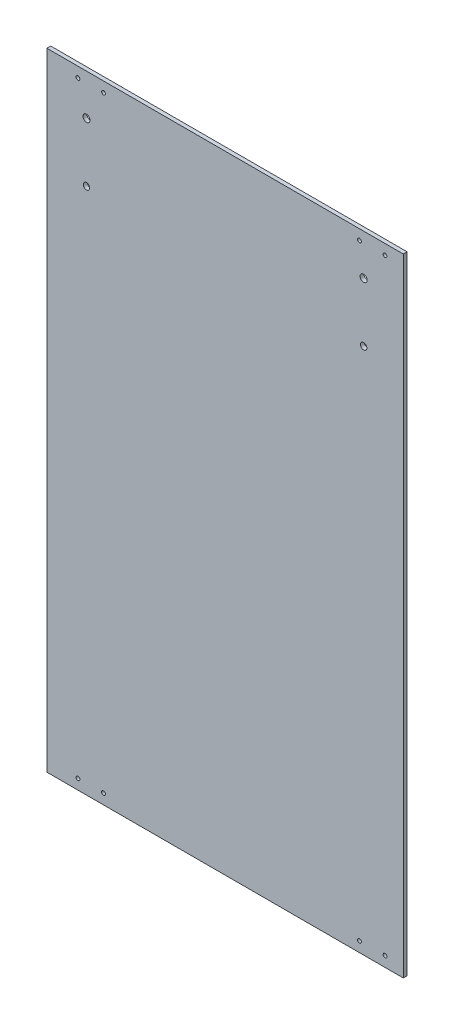
ISO-10303-21;
HEADER;
FILE_DESCRIPTION(('STEP AP214'),'2;1');
FILE_NAME('part.step','',(''),(''),'','','');
FILE_SCHEMA(('AUTOMOTIVE_DESIGN { 1 0 10303 214 1 1 1 1 }'));
ENDSEC;
DATA;
#1=APPLICATION_CONTEXT('core data for automotive mechanical design processes');
#2=APPLICATION_PROTOCOL_DEFINITION('international standard','automotive_design',2000,#1);
#3=PRODUCT_CONTEXT('',#1,'mechanical');
#4=PRODUCT('Part','Part','',(#3));
#5=PRODUCT_RELATED_PRODUCT_CATEGORY('part','',(#4));
#6=PRODUCT_DEFINITION_FORMATION('','',#4);
#7=PRODUCT_DEFINITION_CONTEXT('part definition',#1,'design');
#8=PRODUCT_DEFINITION('design','',#6,#7);
#9=PRODUCT_DEFINITION_SHAPE('','',#8);
#10=(LENGTH_UNIT() NAMED_UNIT(*) SI_UNIT(.MILLI.,.METRE.));
#11=(NAMED_UNIT(*) PLANE_ANGLE_UNIT() SI_UNIT($,.RADIAN.));
#12=(NAMED_UNIT(*) SI_UNIT($,.STERADIAN.) SOLID_ANGLE_UNIT());
#13=UNCERTAINTY_MEASURE_WITH_UNIT(LENGTH_MEASURE(1.E-05),#10,'distance_accuracy_value','');
#14=(GEOMETRIC_REPRESENTATION_CONTEXT(3) GLOBAL_UNCERTAINTY_ASSIGNED_CONTEXT((#13)) GLOBAL_UNIT_ASSIGNED_CONTEXT((#10,
#11,#12)) REPRESENTATION_CONTEXT('',''));
#15=CARTESIAN_POINT('',(0.,0.,0.));
#16=DIRECTION('',(0.,0.,1.));
#17=DIRECTION('',(1.,0.,0.));
#18=AXIS2_PLACEMENT_3D('',#15,#16,#17);
#19=CARTESIAN_POINT('',(0.,0.,3.));
#20=DIRECTION('',(0.,0.,1.));
#21=DIRECTION('',(1.,0.,0.));
#22=AXIS2_PLACEMENT_3D('',#19,#20,#21);
#23=PLANE('',#22);
#24=CARTESIAN_POINT('',(-108.284794003432,213.088125341744,3.));
#25=DIRECTION('',(0.,0.,-1.));
#26=DIRECTION('',(-1.,0.,0.));
#27=AXIS2_PLACEMENT_3D('',#24,#25,#26);
#28=CIRCLE('',#27,2.75);
#29=CARTESIAN_POINT('',(-111.034794003432,213.088125341744,3.));
#30=VERTEX_POINT('',#29);
#31=EDGE_CURVE('E116',#30,#30,#28,.T.);
#32=ORIENTED_EDGE('',*,*,#31,.T.);
#33=EDGE_LOOP('',(#32));
#34=FACE_BOUND('',#33,.T.);
#35=CARTESIAN_POINT('',(108.275205996571,213.088125341673,3.));
#36=DIRECTION('',(0.,0.,-1.));
#37=DIRECTION('',(-1.,0.,0.));
#38=AXIS2_PLACEMENT_3D('',#35,#36,#37);
#39=CIRCLE('',#38,2.75000000000001);
#40=CARTESIAN_POINT('',(105.525205996571,213.088125341673,3.));
#41=VERTEX_POINT('',#40);
#42=EDGE_CURVE('E122',#41,#41,#39,.T.);
#43=ORIENTED_EDGE('',*,*,#42,.T.);
#44=EDGE_LOOP('',(#43));
#45=FACE_BOUND('',#44,.T.);
#46=CARTESIAN_POINT('',(108.275205996571,167.088125341673,3.));
#47=DIRECTION('',(0.,0.,1.));
#48=DIRECTION('',(1.,0.,0.));
#49=AXIS2_PLACEMENT_3D('',#46,#47,#48);
#50=CIRCLE('',#49,2.5);
#51=CARTESIAN_POINT('',(110.775205996571,167.088125341673,3.));
#52=VERTEX_POINT('',#51);
#53=EDGE_CURVE('E137',#52,#52,#50,.T.);
#54=ORIENTED_EDGE('',*,*,#53,.F.);
#55=EDGE_LOOP('',(#54));
#56=FACE_BOUND('',#55,.T.);
#57=CARTESIAN_POINT('',(-108.284794003432,167.088125341744,3.));
#58=DIRECTION('',(0.,0.,1.));
#59=DIRECTION('',(1.,0.,0.));
#60=AXIS2_PLACEMENT_3D('',#57,#58,#59);
#61=CIRCLE('',#60,2.5);
#62=CARTESIAN_POINT('',(-105.784794003432,167.088125341744,3.));
#63=VERTEX_POINT('',#62);
#64=EDGE_CURVE('E132',#63,#63,#61,.T.);
#65=ORIENTED_EDGE('',*,*,#64,.F.);
#66=EDGE_LOOP('',(#65));
#67=FACE_BOUND('',#66,.T.);
#68=CARTESIAN_POINT('',(-95.000929926417,-237.,3.));
#69=DIRECTION('',(0.,0.,1.));
#70=DIRECTION('',(1.,0.,0.));
#71=AXIS2_PLACEMENT_3D('',#68,#69,#70);
#72=CIRCLE('',#71,1.5);
#73=CARTESIAN_POINT('',(-93.500929926417,-237.,3.));
#74=VERTEX_POINT('',#73);
#75=EDGE_CURVE('E147',#74,#74,#72,.T.);
#76=ORIENTED_EDGE('',*,*,#75,.F.);
#77=EDGE_LOOP('',(#76));
#78=FACE_BOUND('',#77,.T.);
#79=CARTESIAN_POINT('',(124.999070073583,-237.,3.));
#80=DIRECTION('',(0.,0.,1.));
#81=DIRECTION('',(1.,0.,0.));
#82=AXIS2_PLACEMENT_3D('',#79,#80,#81);
#83=CIRCLE('',#82,1.5);
#84=CARTESIAN_POINT('',(126.499070073583,-237.,3.));
#85=VERTEX_POINT('',#84);
#86=EDGE_CURVE('E159',#85,#85,#83,.T.);
#87=ORIENTED_EDGE('',*,*,#86,.F.);
#88=EDGE_LOOP('',(#87));
#89=FACE_BOUND('',#88,.T.);
#90=CARTESIAN_POINT('',(-95.0009299264166,237.,3.));
#91=DIRECTION('',(0.,0.,1.));
#92=DIRECTION('',(1.,0.,0.));
#93=AXIS2_PLACEMENT_3D('',#90,#91,#92);
#94=CIRCLE('',#93,1.5);
#95=CARTESIAN_POINT('',(-93.5009299264166,237.,3.));
#96=VERTEX_POINT('',#95);
#97=EDGE_CURVE('E171',#96,#96,#94,.T.);
#98=ORIENTED_EDGE('',*,*,#97,.F.);
#99=EDGE_LOOP('',(#98));
#100=FACE_BOUND('',#99,.T.);
#101=CARTESIAN_POINT('',(104.999070073583,237.,3.));
#102=DIRECTION('',(0.,0.,1.));
#103=DIRECTION('',(1.,0.,0.));
#104=AXIS2_PLACEMENT_3D('',#101,#102,#103);
#105=CIRCLE('',#104,1.5);
#106=CARTESIAN_POINT('',(106.499070073583,237.,3.));
#107=VERTEX_POINT('',#106);
#108=EDGE_CURVE('E109',#107,#107,#105,.T.);
#109=ORIENTED_EDGE('',*,*,#108,.F.);
#110=EDGE_LOOP('',(#109));
#111=FACE_BOUND('',#110,.T.);
#112=DIRECTION('',(0.,1.,0.));
#113=VECTOR('',#112,1.);
#114=CARTESIAN_POINT('',(139.28,245.,3.));
#115=LINE('',#114,#113);
#116=CARTESIAN_POINT('',(139.28,-245.,3.));
#117=VERTEX_POINT('',#116);
#118=CARTESIAN_POINT('',(139.28,245.,3.));
#119=VERTEX_POINT('',#118);
#120=EDGE_CURVE('E93',#117,#119,#115,.T.);
#121=ORIENTED_EDGE('',*,*,#120,.T.);
#122=DIRECTION('',(-1.,0.,0.));
#123=VECTOR('',#122,1.);
#124=CARTESIAN_POINT('',(-139.28,245.,3.));
#125=LINE('',#124,#123);
#126=CARTESIAN_POINT('',(-139.28,245.,3.));
#127=VERTEX_POINT('',#126);
#128=EDGE_CURVE('E88',#119,#127,#125,.T.);
#129=ORIENTED_EDGE('',*,*,#128,.T.);
#130=DIRECTION('',(0.,-1.,0.));
#131=VECTOR('',#130,1.);
#132=CARTESIAN_POINT('',(-139.28,245.,3.));
#133=LINE('',#132,#131);
#134=CARTESIAN_POINT('',(-139.28,-245.,3.));
#135=VERTEX_POINT('',#134);
#136=EDGE_CURVE('E91',#127,#135,#133,.T.);
#137=ORIENTED_EDGE('',*,*,#136,.T.);
#138=DIRECTION('',(1.,0.,0.));
#139=VECTOR('',#138,1.);
#140=CARTESIAN_POINT('',(-139.28,-245.,3.));
#141=LINE('',#140,#139);
#142=EDGE_CURVE('E58',#135,#117,#141,.T.);
#143=ORIENTED_EDGE('',*,*,#142,.T.);
#144=EDGE_LOOP('',(#121,#129,#137,#143));
#145=FACE_BOUND('',#144,.T.);
#146=CARTESIAN_POINT('',(124.999070073583,237.,3.));
#147=DIRECTION('',(0.,0.,1.));
#148=DIRECTION('',(1.,0.,0.));
#149=AXIS2_PLACEMENT_3D('',#146,#147,#148);
#150=CIRCLE('',#149,1.5);
#151=CARTESIAN_POINT('',(126.499070073583,237.,3.));
#152=VERTEX_POINT('',#151);
#153=EDGE_CURVE('E177',#152,#152,#150,.T.);
#154=ORIENTED_EDGE('',*,*,#153,.F.);
#155=EDGE_LOOP('',(#154));
#156=FACE_BOUND('',#155,.T.);
#157=CARTESIAN_POINT('',(-115.000929926417,237.,3.));
#158=DIRECTION('',(0.,0.,1.));
#159=DIRECTION('',(1.,0.,0.));
#160=AXIS2_PLACEMENT_3D('',#157,#158,#159);
#161=CIRCLE('',#160,1.5);
#162=CARTESIAN_POINT('',(-113.500929926417,237.,3.));
#163=VERTEX_POINT('',#162);
#164=EDGE_CURVE('E165',#163,#163,#161,.T.);
#165=ORIENTED_EDGE('',*,*,#164,.F.);
#166=EDGE_LOOP('',(#165));
#167=FACE_BOUND('',#166,.T.);
#168=CARTESIAN_POINT('',(104.999070073583,-237.,3.));
#169=DIRECTION('',(0.,0.,1.));
#170=DIRECTION('',(1.,0.,0.));
#171=AXIS2_PLACEMENT_3D('',#168,#169,#170);
#172=CIRCLE('',#171,1.5);
#173=CARTESIAN_POINT('',(106.499070073583,-237.,3.));
#174=VERTEX_POINT('',#173);
#175=EDGE_CURVE('E153',#174,#174,#172,.T.);
#176=ORIENTED_EDGE('',*,*,#175,.F.);
#177=EDGE_LOOP('',(#176));
#178=FACE_BOUND('',#177,.T.);
#179=CARTESIAN_POINT('',(-115.000929926417,-237.,3.));
#180=DIRECTION('',(0.,0.,1.));
#181=DIRECTION('',(1.,0.,0.));
#182=AXIS2_PLACEMENT_3D('',#179,#180,#181);
#183=CIRCLE('',#182,1.5);
#184=CARTESIAN_POINT('',(-113.500929926417,-237.,3.));
#185=VERTEX_POINT('',#184);
#186=EDGE_CURVE('E141',#185,#185,#183,.T.);
#187=ORIENTED_EDGE('',*,*,#186,.F.);
#188=EDGE_LOOP('',(#187));
#189=FACE_BOUND('',#188,.T.);
#190=ADVANCED_FACE('F39',(#34,#45,#56,#67,#78,#89,#100,#111,#145,#156,#167,#178,#189),#23,.T.);
#191=CARTESIAN_POINT('',(0.,0.,0.));
#192=DIRECTION('',(0.,0.,1.));
#193=DIRECTION('',(1.,0.,0.));
#194=AXIS2_PLACEMENT_3D('',#191,#192,#193);
#195=PLANE('',#194);
#196=CARTESIAN_POINT('',(-108.284794003432,213.088125341744,0.));
#197=DIRECTION('',(0.,0.,1.));
#198=DIRECTION('',(1.,0.,0.));
#199=AXIS2_PLACEMENT_3D('',#196,#197,#198);
#200=CIRCLE('',#199,2.75);
#201=CARTESIAN_POINT('',(-105.534794003432,213.088125341744,0.));
#202=VERTEX_POINT('',#201);
#203=EDGE_CURVE('E43',#202,#202,#200,.T.);
#204=ORIENTED_EDGE('',*,*,#203,.T.);
#205=EDGE_LOOP('',(#204));
#206=FACE_BOUND('',#205,.T.);
#207=CARTESIAN_POINT('',(108.275205996571,213.088125341673,0.));
#208=DIRECTION('',(0.,0.,1.));
#209=DIRECTION('',(1.,0.,0.));
#210=AXIS2_PLACEMENT_3D('',#207,#208,#209);
#211=CIRCLE('',#210,2.75000000000001);
#212=CARTESIAN_POINT('',(111.025205996571,213.088125341673,0.));
#213=VERTEX_POINT('',#212);
#214=EDGE_CURVE('E114',#213,#213,#211,.T.);
#215=ORIENTED_EDGE('',*,*,#214,.T.);
#216=EDGE_LOOP('',(#215));
#217=FACE_BOUND('',#216,.T.);
#218=CARTESIAN_POINT('',(108.275205996571,167.088125341673,0.));
#219=DIRECTION('',(0.,0.,-1.));
#220=DIRECTION('',(-1.,0.,0.));
#221=AXIS2_PLACEMENT_3D('',#218,#219,#220);
#222=CIRCLE('',#221,2.5);
#223=CARTESIAN_POINT('',(105.775205996571,167.088125341673,0.));
#224=VERTEX_POINT('',#223);
#225=EDGE_CURVE('E129',#224,#224,#222,.T.);
#226=ORIENTED_EDGE('',*,*,#225,.F.);
#227=EDGE_LOOP('',(#226));
#228=FACE_BOUND('',#227,.T.);
#229=CARTESIAN_POINT('',(-108.284794003432,167.088125341744,0.));
#230=DIRECTION('',(0.,0.,-1.));
#231=DIRECTION('',(-1.,0.,0.));
#232=AXIS2_PLACEMENT_3D('',#229,#230,#231);
#233=CIRCLE('',#232,2.5);
#234=CARTESIAN_POINT('',(-110.784794003432,167.088125341744,0.));
#235=VERTEX_POINT('',#234);
#236=EDGE_CURVE('E120',#235,#235,#233,.T.);
#237=ORIENTED_EDGE('',*,*,#236,.F.);
#238=EDGE_LOOP('',(#237));
#239=FACE_BOUND('',#238,.T.);
#240=DIRECTION('',(0.,1.,0.));
#241=VECTOR('',#240,1.);
#242=CARTESIAN_POINT('',(139.28,245.,0.));
#243=LINE('',#242,#241);
#244=CARTESIAN_POINT('',(139.28,-245.,0.));
#245=VERTEX_POINT('',#244);
#246=CARTESIAN_POINT('',(139.28,245.,0.));
#247=VERTEX_POINT('',#246);
#248=EDGE_CURVE('E106',#245,#247,#243,.T.);
#249=ORIENTED_EDGE('',*,*,#248,.F.);
#250=DIRECTION('',(1.,0.,0.));
#251=VECTOR('',#250,1.);
#252=CARTESIAN_POINT('',(-139.28,-245.,0.));
#253=LINE('',#252,#251);
#254=CARTESIAN_POINT('',(-139.28,-245.,0.));
#255=VERTEX_POINT('',#254);
#256=EDGE_CURVE('E81',#255,#245,#253,.T.);
#257=ORIENTED_EDGE('',*,*,#256,.F.);
#258=DIRECTION('',(0.,-1.,0.));
#259=VECTOR('',#258,1.);
#260=CARTESIAN_POINT('',(-139.28,245.,0.));
#261=LINE('',#260,#259);
#262=CARTESIAN_POINT('',(-139.28,245.,0.));
#263=VERTEX_POINT('',#262);
#264=EDGE_CURVE('E75',#263,#255,#261,.T.);
#265=ORIENTED_EDGE('',*,*,#264,.F.);
#266=DIRECTION('',(-1.,0.,0.));
#267=VECTOR('',#266,1.);
#268=CARTESIAN_POINT('',(-139.28,245.,0.));
#269=LINE('',#268,#267);
#270=EDGE_CURVE('E97',#247,#263,#269,.T.);
#271=ORIENTED_EDGE('',*,*,#270,.F.);
#272=EDGE_LOOP('',(#249,#257,#265,#271));
#273=FACE_BOUND('',#272,.T.);
#274=CARTESIAN_POINT('',(104.999070073583,237.,0.));
#275=DIRECTION('',(0.,0.,1.));
#276=DIRECTION('',(1.,0.,0.));
#277=AXIS2_PLACEMENT_3D('',#274,#275,#276);
#278=CIRCLE('',#277,1.5);
#279=CARTESIAN_POINT('',(106.499070073583,237.,0.));
#280=VERTEX_POINT('',#279);
#281=EDGE_CURVE('E180',#280,#280,#278,.T.);
#282=ORIENTED_EDGE('',*,*,#281,.T.);
#283=EDGE_LOOP('',(#282));
#284=FACE_BOUND('',#283,.T.);
#285=CARTESIAN_POINT('',(124.999070073583,237.,0.));
#286=DIRECTION('',(0.,0.,1.));
#287=DIRECTION('',(1.,0.,0.));
#288=AXIS2_PLACEMENT_3D('',#285,#286,#287);
#289=CIRCLE('',#288,1.5);
#290=CARTESIAN_POINT('',(126.499070073583,237.,0.));
#291=VERTEX_POINT('',#290);
#292=EDGE_CURVE('E174',#291,#291,#289,.T.);
#293=ORIENTED_EDGE('',*,*,#292,.T.);
#294=EDGE_LOOP('',(#293));
#295=FACE_BOUND('',#294,.T.);
#296=CARTESIAN_POINT('',(-95.0009299264166,237.,0.));
#297=DIRECTION('',(0.,0.,1.));
#298=DIRECTION('',(1.,0.,0.));
#299=AXIS2_PLACEMENT_3D('',#296,#297,#298);
#300=CIRCLE('',#299,1.5);
#301=CARTESIAN_POINT('',(-93.5009299264166,237.,0.));
#302=VERTEX_POINT('',#301);
#303=EDGE_CURVE('E168',#302,#302,#300,.T.);
#304=ORIENTED_EDGE('',*,*,#303,.T.);
#305=EDGE_LOOP('',(#304));
#306=FACE_BOUND('',#305,.T.);
#307=CARTESIAN_POINT('',(-115.000929926417,237.,0.));
#308=DIRECTION('',(0.,0.,1.));
#309=DIRECTION('',(1.,0.,0.));
#310=AXIS2_PLACEMENT_3D('',#307,#308,#309);
#311=CIRCLE('',#310,1.5);
#312=CARTESIAN_POINT('',(-113.500929926417,237.,0.));
#313=VERTEX_POINT('',#312);
#314=EDGE_CURVE('E162',#313,#313,#311,.T.);
#315=ORIENTED_EDGE('',*,*,#314,.T.);
#316=EDGE_LOOP('',(#315));
#317=FACE_BOUND('',#316,.T.);
#318=CARTESIAN_POINT('',(124.999070073583,-237.,0.));
#319=DIRECTION('',(0.,0.,1.));
#320=DIRECTION('',(1.,0.,0.));
#321=AXIS2_PLACEMENT_3D('',#318,#319,#320);
#322=CIRCLE('',#321,1.5);
#323=CARTESIAN_POINT('',(126.499070073583,-237.,0.));
#324=VERTEX_POINT('',#323);
#325=EDGE_CURVE('E156',#324,#324,#322,.T.);
#326=ORIENTED_EDGE('',*,*,#325,.T.);
#327=EDGE_LOOP('',(#326));
#328=FACE_BOUND('',#327,.T.);
#329=CARTESIAN_POINT('',(104.999070073583,-237.,0.));
#330=DIRECTION('',(0.,0.,1.));
#331=DIRECTION('',(1.,0.,0.));
#332=AXIS2_PLACEMENT_3D('',#329,#330,#331);
#333=CIRCLE('',#332,1.5);
#334=CARTESIAN_POINT('',(106.499070073583,-237.,0.));
#335=VERTEX_POINT('',#334);
#336=EDGE_CURVE('E150',#335,#335,#333,.T.);
#337=ORIENTED_EDGE('',*,*,#336,.T.);
#338=EDGE_LOOP('',(#337));
#339=FACE_BOUND('',#338,.T.);
#340=CARTESIAN_POINT('',(-95.000929926417,-237.,0.));
#341=DIRECTION('',(0.,0.,1.));
#342=DIRECTION('',(1.,0.,0.));
#343=AXIS2_PLACEMENT_3D('',#340,#341,#342);
#344=CIRCLE('',#343,1.5);
#345=CARTESIAN_POINT('',(-93.500929926417,-237.,0.));
#346=VERTEX_POINT('',#345);
#347=EDGE_CURVE('E144',#346,#346,#344,.T.);
#348=ORIENTED_EDGE('',*,*,#347,.T.);
#349=EDGE_LOOP('',(#348));
#350=FACE_BOUND('',#349,.T.);
#351=CARTESIAN_POINT('',(-115.000929926417,-237.,0.));
#352=DIRECTION('',(0.,0.,1.));
#353=DIRECTION('',(1.,0.,0.));
#354=AXIS2_PLACEMENT_3D('',#351,#352,#353);
#355=CIRCLE('',#354,1.5);
#356=CARTESIAN_POINT('',(-113.500929926417,-237.,0.));
#357=VERTEX_POINT('',#356);
#358=EDGE_CURVE('E140',#357,#357,#355,.T.);
#359=ORIENTED_EDGE('',*,*,#358,.T.);
#360=EDGE_LOOP('',(#359));
#361=FACE_BOUND('',#360,.T.);
#362=ADVANCED_FACE('F188',(#206,#217,#228,#239,#273,#284,#295,#306,#317,#328,#339,#350,#361),
#195,.F.);
#363=CARTESIAN_POINT('',(139.28,245.,3.));
#364=DIRECTION('',(-1.,0.,0.));
#365=DIRECTION('',(0.,-1.,0.));
#366=AXIS2_PLACEMENT_3D('',#363,#364,#365);
#367=PLANE('',#366);
#368=ORIENTED_EDGE('',*,*,#248,.T.);
#369=DIRECTION('',(0.,0.,-1.));
#370=VECTOR('',#369,1.);
#371=CARTESIAN_POINT('',(139.28,245.,3.));
#372=LINE('',#371,#370);
#373=EDGE_CURVE('E11',#119,#247,#372,.T.);
#374=ORIENTED_EDGE('',*,*,#373,.F.);
#375=ORIENTED_EDGE('',*,*,#120,.F.);
#376=DIRECTION('',(0.,0.,-1.));
#377=VECTOR('',#376,1.);
#378=CARTESIAN_POINT('',(139.28,-245.,3.));
#379=LINE('',#378,#377);
#380=EDGE_CURVE('E102',#117,#245,#379,.T.);
#381=ORIENTED_EDGE('',*,*,#380,.T.);
#382=EDGE_LOOP('',(#368,#374,#375,#381));
#383=FACE_BOUND('',#382,.T.);
#384=ADVANCED_FACE('F41',(#383),#367,.F.);
#385=CARTESIAN_POINT('',(-139.28,245.,3.));
#386=DIRECTION('',(0.,-1.,0.));
#387=DIRECTION('',(0.,0.,-1.));
#388=AXIS2_PLACEMENT_3D('',#385,#386,#387);
#389=PLANE('',#388);
#390=ORIENTED_EDGE('',*,*,#270,.T.);
#391=DIRECTION('',(0.,0.,-1.));
#392=VECTOR('',#391,1.);
#393=CARTESIAN_POINT('',(-139.28,245.,3.));
#394=LINE('',#393,#392);
#395=EDGE_CURVE('E49',#127,#263,#394,.T.);
#396=ORIENTED_EDGE('',*,*,#395,.F.);
#397=ORIENTED_EDGE('',*,*,#128,.F.);
#398=ORIENTED_EDGE('',*,*,#373,.T.);
#399=EDGE_LOOP('',(#390,#396,#397,#398));
#400=FACE_BOUND('',#399,.T.);
#401=ADVANCED_FACE('F96',(#400),#389,.F.);
#402=CARTESIAN_POINT('',(-139.28,245.,3.));
#403=DIRECTION('',(1.,0.,0.));
#404=DIRECTION('',(0.,1.,0.));
#405=AXIS2_PLACEMENT_3D('',#402,#403,#404);
#406=PLANE('',#405);
#407=ORIENTED_EDGE('',*,*,#264,.T.);
#408=DIRECTION('',(0.,0.,-1.));
#409=VECTOR('',#408,1.);
#410=CARTESIAN_POINT('',(-139.28,-245.,3.));
#411=LINE('',#410,#409);
#412=EDGE_CURVE('E98',#135,#255,#411,.T.);
#413=ORIENTED_EDGE('',*,*,#412,.F.);
#414=ORIENTED_EDGE('',*,*,#136,.F.);
#415=ORIENTED_EDGE('',*,*,#395,.T.);
#416=EDGE_LOOP('',(#407,#413,#414,#415));
#417=FACE_BOUND('',#416,.T.);
#418=ADVANCED_FACE('F100',(#417),#406,.F.);
#419=CARTESIAN_POINT('',(-139.28,-245.,3.));
#420=DIRECTION('',(0.,1.,0.));
#421=DIRECTION('',(0.,0.,1.));
#422=AXIS2_PLACEMENT_3D('',#419,#420,#421);
#423=PLANE('',#422);
#424=ORIENTED_EDGE('',*,*,#256,.T.);
#425=ORIENTED_EDGE('',*,*,#380,.F.);
#426=ORIENTED_EDGE('',*,*,#142,.F.);
#427=ORIENTED_EDGE('',*,*,#412,.T.);
#428=EDGE_LOOP('',(#424,#425,#426,#427));
#429=FACE_BOUND('',#428,.T.);
#430=ADVANCED_FACE('F194',(#429),#423,.F.);
#431=CARTESIAN_POINT('',(104.999070073583,237.,3.));
#432=DIRECTION('',(0.,0.,-1.));
#433=DIRECTION('',(-1.,0.,0.));
#434=AXIS2_PLACEMENT_3D('',#431,#432,#433);
#435=CYLINDRICAL_SURFACE('',#434,1.5);
#436=ORIENTED_EDGE('',*,*,#108,.T.);
#437=EDGE_LOOP('',(#436));
#438=FACE_BOUND('',#437,.T.);
#439=ORIENTED_EDGE('',*,*,#281,.F.);
#440=EDGE_LOOP('',(#439));
#441=FACE_BOUND('',#440,.T.);
#442=ADVANCED_FACE('F191',(#438,#441),#435,.F.);
#443=CARTESIAN_POINT('',(124.999070073583,237.,3.));
#444=DIRECTION('',(0.,0.,-1.));
#445=DIRECTION('',(-1.,0.,0.));
#446=AXIS2_PLACEMENT_3D('',#443,#444,#445);
#447=CYLINDRICAL_SURFACE('',#446,1.5);
#448=ORIENTED_EDGE('',*,*,#153,.T.);
#449=EDGE_LOOP('',(#448));
#450=FACE_BOUND('',#449,.T.);
#451=ORIENTED_EDGE('',*,*,#292,.F.);
#452=EDGE_LOOP('',(#451));
#453=FACE_BOUND('',#452,.T.);
#454=ADVANCED_FACE('F193',(#450,#453),#447,.F.);
#455=CARTESIAN_POINT('',(-95.0009299264166,237.,3.));
#456=DIRECTION('',(0.,0.,-1.));
#457=DIRECTION('',(-1.,0.,0.));
#458=AXIS2_PLACEMENT_3D('',#455,#456,#457);
#459=CYLINDRICAL_SURFACE('',#458,1.5);
#460=ORIENTED_EDGE('',*,*,#97,.T.);
#461=EDGE_LOOP('',(#460));
#462=FACE_BOUND('',#461,.T.);
#463=ORIENTED_EDGE('',*,*,#303,.F.);
#464=EDGE_LOOP('',(#463));
#465=FACE_BOUND('',#464,.T.);
#466=ADVANCED_FACE('F201',(#462,#465),#459,.F.);
#467=CARTESIAN_POINT('',(-115.000929926417,237.,3.));
#468=DIRECTION('',(0.,0.,-1.));
#469=DIRECTION('',(-1.,0.,0.));
#470=AXIS2_PLACEMENT_3D('',#467,#468,#469);
#471=CYLINDRICAL_SURFACE('',#470,1.5);
#472=ORIENTED_EDGE('',*,*,#164,.T.);
#473=EDGE_LOOP('',(#472));
#474=FACE_BOUND('',#473,.T.);
#475=ORIENTED_EDGE('',*,*,#314,.F.);
#476=EDGE_LOOP('',(#475));
#477=FACE_BOUND('',#476,.T.);
#478=ADVANCED_FACE('F315',(#474,#477),#471,.F.);
#479=CARTESIAN_POINT('',(124.999070073583,-237.,3.));
#480=DIRECTION('',(0.,0.,-1.));
#481=DIRECTION('',(-1.,0.,0.));
#482=AXIS2_PLACEMENT_3D('',#479,#480,#481);
#483=CYLINDRICAL_SURFACE('',#482,1.5);
#484=ORIENTED_EDGE('',*,*,#86,.T.);
#485=EDGE_LOOP('',(#484));
#486=FACE_BOUND('',#485,.T.);
#487=ORIENTED_EDGE('',*,*,#325,.F.);
#488=EDGE_LOOP('',(#487));
#489=FACE_BOUND('',#488,.T.);
#490=ADVANCED_FACE('F305',(#486,#489),#483,.F.);
#491=CARTESIAN_POINT('',(104.999070073583,-237.,3.));
#492=DIRECTION('',(0.,0.,-1.));
#493=DIRECTION('',(-1.,0.,0.));
#494=AXIS2_PLACEMENT_3D('',#491,#492,#493);
#495=CYLINDRICAL_SURFACE('',#494,1.5);
#496=ORIENTED_EDGE('',*,*,#175,.T.);
#497=EDGE_LOOP('',(#496));
#498=FACE_BOUND('',#497,.T.);
#499=ORIENTED_EDGE('',*,*,#336,.F.);
#500=EDGE_LOOP('',(#499));
#501=FACE_BOUND('',#500,.T.);
#502=ADVANCED_FACE('F295',(#498,#501),#495,.F.);
#503=CARTESIAN_POINT('',(-95.000929926417,-237.,3.));
#504=DIRECTION('',(0.,0.,-1.));
#505=DIRECTION('',(-1.,0.,0.));
#506=AXIS2_PLACEMENT_3D('',#503,#504,#505);
#507=CYLINDRICAL_SURFACE('',#506,1.5);
#508=ORIENTED_EDGE('',*,*,#75,.T.);
#509=EDGE_LOOP('',(#508));
#510=FACE_BOUND('',#509,.T.);
#511=ORIENTED_EDGE('',*,*,#347,.F.);
#512=EDGE_LOOP('',(#511));
#513=FACE_BOUND('',#512,.T.);
#514=ADVANCED_FACE('F285',(#510,#513),#507,.F.);
#515=CARTESIAN_POINT('',(-115.000929926417,-237.,3.));
#516=DIRECTION('',(0.,0.,-1.));
#517=DIRECTION('',(-1.,0.,0.));
#518=AXIS2_PLACEMENT_3D('',#515,#516,#517);
#519=CYLINDRICAL_SURFACE('',#518,1.5);
#520=ORIENTED_EDGE('',*,*,#186,.T.);
#521=EDGE_LOOP('',(#520));
#522=FACE_BOUND('',#521,.T.);
#523=ORIENTED_EDGE('',*,*,#358,.F.);
#524=EDGE_LOOP('',(#523));
#525=FACE_BOUND('',#524,.T.);
#526=ADVANCED_FACE('F275',(#522,#525),#519,.F.);
#527=CARTESIAN_POINT('',(-108.284794003432,167.088125341744,10.));
#528=DIRECTION('',(0.,0.,-1.));
#529=DIRECTION('',(-1.,0.,0.));
#530=AXIS2_PLACEMENT_3D('',#527,#528,#529);
#531=CYLINDRICAL_SURFACE('',#530,2.5);
#532=ORIENTED_EDGE('',*,*,#64,.T.);
#533=EDGE_LOOP('',(#532));
#534=FACE_BOUND('',#533,.T.);
#535=ORIENTED_EDGE('',*,*,#236,.T.);
#536=EDGE_LOOP('',(#535));
#537=FACE_BOUND('',#536,.T.);
#538=ADVANCED_FACE('F266',(#534,#537),#531,.F.);
#539=CARTESIAN_POINT('',(108.275205996571,167.088125341673,10.));
#540=DIRECTION('',(0.,0.,-1.));
#541=DIRECTION('',(-1.,0.,0.));
#542=AXIS2_PLACEMENT_3D('',#539,#540,#541);
#543=CYLINDRICAL_SURFACE('',#542,2.5);
#544=ORIENTED_EDGE('',*,*,#53,.T.);
#545=EDGE_LOOP('',(#544));
#546=FACE_BOUND('',#545,.T.);
#547=ORIENTED_EDGE('',*,*,#225,.T.);
#548=EDGE_LOOP('',(#547));
#549=FACE_BOUND('',#548,.T.);
#550=ADVANCED_FACE('F243',(#546,#549),#543,.F.);
#551=CARTESIAN_POINT('',(108.275205996571,213.088125341673,3.));
#552=DIRECTION('',(0.,0.,-1.));
#553=DIRECTION('',(-1.,0.,0.));
#554=AXIS2_PLACEMENT_3D('',#551,#552,#553);
#555=CYLINDRICAL_SURFACE('',#554,2.75000000000001);
#556=ORIENTED_EDGE('',*,*,#42,.F.);
#557=EDGE_LOOP('',(#556));
#558=FACE_BOUND('',#557,.T.);
#559=ORIENTED_EDGE('',*,*,#214,.F.);
#560=EDGE_LOOP('',(#559));
#561=FACE_BOUND('',#560,.T.);
#562=ADVANCED_FACE('F237',(#558,#561),#555,.F.);
#563=CARTESIAN_POINT('',(-108.284794003432,213.088125341744,3.));
#564=DIRECTION('',(0.,0.,-1.));
#565=DIRECTION('',(-1.,0.,0.));
#566=AXIS2_PLACEMENT_3D('',#563,#564,#565);
#567=CYLINDRICAL_SURFACE('',#566,2.75);
#568=ORIENTED_EDGE('',*,*,#31,.F.);
#569=EDGE_LOOP('',(#568));
#570=FACE_BOUND('',#569,.T.);
#571=ORIENTED_EDGE('',*,*,#203,.F.);
#572=EDGE_LOOP('',(#571));
#573=FACE_BOUND('',#572,.T.);
#574=ADVANCED_FACE('F242',(#570,#573),#567,.F.);
#575=CLOSED_SHELL('',(#190,#362,#384,#401,#418,#430,#442,#454,#466,#478,#490,#502,#514,#526,
#538,#550,#562,#574));
#576=MANIFOLD_SOLID_BREP('B2',#575);
#577=ADVANCED_BREP_SHAPE_REPRESENTATION('',(#18,#576),#14);
#578=SHAPE_DEFINITION_REPRESENTATION(#9,#577);
ENDSEC;
END-ISO-10303-21;
